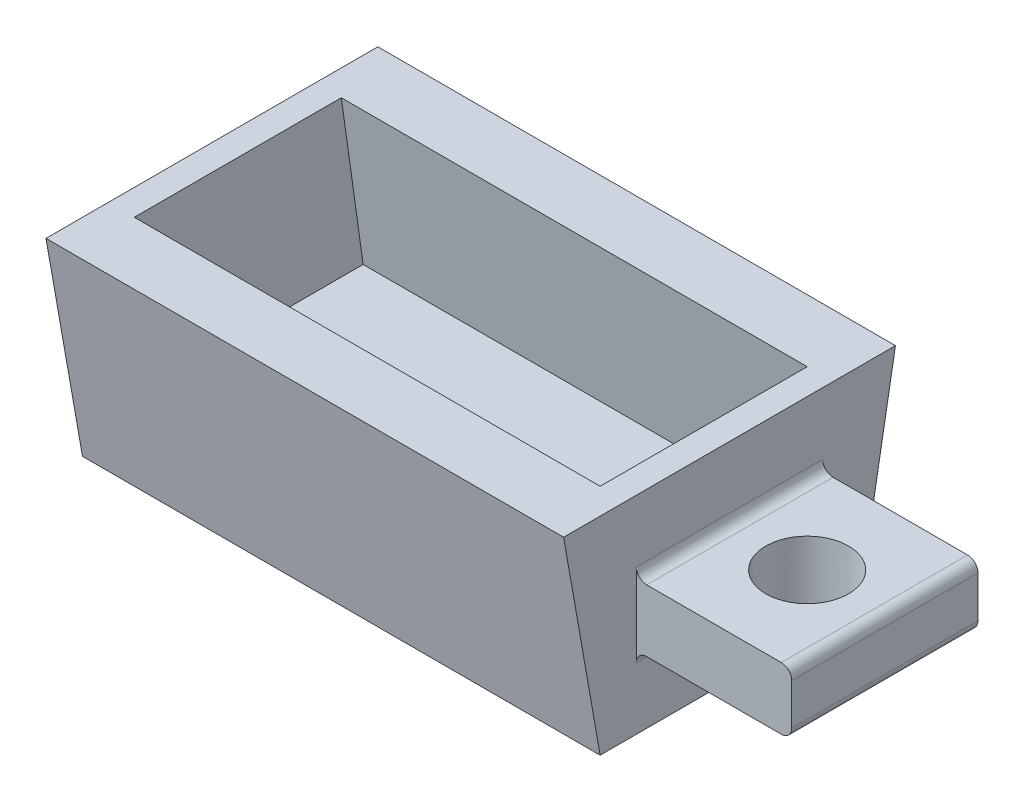
ISO-10303-21;
HEADER;
FILE_DESCRIPTION(('STEP AP214'),'2;1');
FILE_NAME('part.step','',(''),(''),'','','');
FILE_SCHEMA(('AUTOMOTIVE_DESIGN { 1 0 10303 214 1 1 1 1 }'));
ENDSEC;
DATA;
#1=APPLICATION_CONTEXT('core data for automotive mechanical design processes');
#2=APPLICATION_PROTOCOL_DEFINITION('international standard','automotive_design',2000,#1);
#3=PRODUCT_CONTEXT('',#1,'mechanical');
#4=PRODUCT('Part','Part','',(#3));
#5=PRODUCT_RELATED_PRODUCT_CATEGORY('part','',(#4));
#6=PRODUCT_DEFINITION_FORMATION('','',#4);
#7=PRODUCT_DEFINITION_CONTEXT('part definition',#1,'design');
#8=PRODUCT_DEFINITION('design','',#6,#7);
#9=PRODUCT_DEFINITION_SHAPE('','',#8);
#10=(LENGTH_UNIT() NAMED_UNIT(*) SI_UNIT(.MILLI.,.METRE.));
#11=(NAMED_UNIT(*) PLANE_ANGLE_UNIT() SI_UNIT($,.RADIAN.));
#12=(NAMED_UNIT(*) SI_UNIT($,.STERADIAN.) SOLID_ANGLE_UNIT());
#13=UNCERTAINTY_MEASURE_WITH_UNIT(LENGTH_MEASURE(1.E-05),#10,'distance_accuracy_value','');
#14=(GEOMETRIC_REPRESENTATION_CONTEXT(3) GLOBAL_UNCERTAINTY_ASSIGNED_CONTEXT((#13)) GLOBAL_UNIT_ASSIGNED_CONTEXT((#10,
#11,#12)) REPRESENTATION_CONTEXT('',''));
#15=CARTESIAN_POINT('',(0.,0.,0.));
#16=DIRECTION('',(0.,0.,1.));
#17=DIRECTION('',(1.,0.,0.));
#18=AXIS2_PLACEMENT_3D('',#15,#16,#17);
#19=CARTESIAN_POINT('',(50.,40.,-25.));
#20=DIRECTION('',(-1.,0.,0.));
#21=DIRECTION('',(0.,0.,1.));
#22=AXIS2_PLACEMENT_3D('',#19,#20,#21);
#23=PLANE('',#22);
#24=DIRECTION('',(0.,0.,-1.));
#25=VECTOR('',#24,1.);
#26=CARTESIAN_POINT('',(50.,0.,-25.));
#27=LINE('',#26,#25);
#28=CARTESIAN_POINT('',(50.,0.,25.));
#29=VERTEX_POINT('',#28);
#30=CARTESIAN_POINT('',(50.,0.,-25.));
#31=VERTEX_POINT('',#30);
#32=EDGE_CURVE('E248',#29,#31,#27,.T.);
#33=ORIENTED_EDGE('',*,*,#32,.T.);
#34=DIRECTION('',(0.,0.984807753012208,-0.173648177666931));
#35=VECTOR('',#34,1.);
#36=CARTESIAN_POINT('',(50.,0.,-25.));
#37=LINE('',#36,#35);
#38=CARTESIAN_POINT('',(50.,40.,-32.0530792283386));
#39=VERTEX_POINT('',#38);
#40=EDGE_CURVE('E212',#39,#31,#37,.F.);
#41=ORIENTED_EDGE('',*,*,#40,.F.);
#42=DIRECTION('',(0.,0.,-1.));
#43=VECTOR('',#42,1.);
#44=CARTESIAN_POINT('',(50.,40.,-25.));
#45=LINE('',#44,#43);
#46=CARTESIAN_POINT('',(50.,40.,32.0530792283386));
#47=VERTEX_POINT('',#46);
#48=EDGE_CURVE('E222',#47,#39,#45,.T.);
#49=ORIENTED_EDGE('',*,*,#48,.F.);
#50=DIRECTION('',(0.,0.984807753012208,0.173648177666931));
#51=VECTOR('',#50,1.);
#52=CARTESIAN_POINT('',(50.,30.2433488325764,30.3327183861611));
#53=LINE('',#52,#51);
#54=EDGE_CURVE('E230',#47,#29,#53,.F.);
#55=ORIENTED_EDGE('',*,*,#54,.T.);
#56=EDGE_LOOP('',(#33,#41,#49,#55));
#57=FACE_BOUND('',#56,.T.);
#58=DIRECTION('',(0.,1.,0.));
#59=VECTOR('',#58,1.);
#60=CARTESIAN_POINT('',(50.,26.,-18.));
#61=LINE('',#60,#59);
#62=CARTESIAN_POINT('',(50.,12.,-18.));
#63=VERTEX_POINT('',#62);
#64=CARTESIAN_POINT('',(50.,28.,-18.));
#65=VERTEX_POINT('',#64);
#66=EDGE_CURVE('E547',#63,#65,#61,.T.);
#67=ORIENTED_EDGE('',*,*,#66,.F.);
#68=DIRECTION('',(0.,0.,-1.));
#69=VECTOR('',#68,1.);
#70=CARTESIAN_POINT('',(50.,12.,18.));
#71=LINE('',#70,#69);
#72=CARTESIAN_POINT('',(50.,12.,18.));
#73=VERTEX_POINT('',#72);
#74=EDGE_CURVE('E310',#63,#73,#71,.F.);
#75=ORIENTED_EDGE('',*,*,#74,.T.);
#76=DIRECTION('',(0.,-1.,0.));
#77=VECTOR('',#76,1.);
#78=CARTESIAN_POINT('',(50.,26.,18.));
#79=LINE('',#78,#77);
#80=CARTESIAN_POINT('',(50.,28.,18.));
#81=VERTEX_POINT('',#80);
#82=EDGE_CURVE('E181',#81,#73,#79,.T.);
#83=ORIENTED_EDGE('',*,*,#82,.F.);
#84=DIRECTION('',(0.,0.,1.));
#85=VECTOR('',#84,1.);
#86=CARTESIAN_POINT('',(50.,28.,-18.));
#87=LINE('',#86,#85);
#88=EDGE_CURVE('E306',#81,#65,#87,.F.);
#89=ORIENTED_EDGE('',*,*,#88,.T.);
#90=EDGE_LOOP('',(#67,#75,#83,#89));
#91=FACE_BOUND('',#90,.T.);
#92=ADVANCED_FACE('F40',(#57,#91),#23,.F.);
#93=CARTESIAN_POINT('',(-50.,0.,-25.));
#94=DIRECTION('',(0.,-0.173648177666931,-0.984807753012208));
#95=DIRECTION('',(0.,0.984807753012208,-0.173648177666931));
#96=AXIS2_PLACEMENT_3D('',#93,#94,#95);
#97=PLANE('',#96);
#98=DIRECTION('',(-1.,0.,0.));
#99=VECTOR('',#98,1.);
#100=CARTESIAN_POINT('',(-50.,0.,-25.));
#101=LINE('',#100,#99);
#102=CARTESIAN_POINT('',(-50.,0.,-25.));
#103=VERTEX_POINT('',#102);
#104=EDGE_CURVE('E292',#31,#103,#101,.T.);
#105=ORIENTED_EDGE('',*,*,#104,.T.);
#106=DIRECTION('',(0.,0.984807753012208,-0.173648177666931));
#107=VECTOR('',#106,1.);
#108=CARTESIAN_POINT('',(-50.,38.7938524157182,-31.8404028665134));
#109=LINE('',#108,#107);
#110=CARTESIAN_POINT('',(-50.,40.,-32.0530792283386));
#111=VERTEX_POINT('',#110);
#112=EDGE_CURVE('E217',#111,#103,#109,.F.);
#113=ORIENTED_EDGE('',*,*,#112,.F.);
#114=DIRECTION('',(1.,0.,0.));
#115=VECTOR('',#114,1.);
#116=CARTESIAN_POINT('',(-50.,40.,-32.0530792283386));
#117=LINE('',#116,#115);
#118=EDGE_CURVE('E218',#39,#111,#117,.F.);
#119=ORIENTED_EDGE('',*,*,#118,.F.);
#120=ORIENTED_EDGE('',*,*,#40,.T.);
#121=EDGE_LOOP('',(#105,#113,#119,#120));
#122=FACE_BOUND('',#121,.T.);
#123=ADVANCED_FACE('F352',(#122),#97,.T.);
#124=CARTESIAN_POINT('',(-50.,40.,-25.));
#125=DIRECTION('',(1.,0.,0.));
#126=DIRECTION('',(0.,0.,-1.));
#127=AXIS2_PLACEMENT_3D('',#124,#125,#126);
#128=PLANE('',#127);
#129=DIRECTION('',(0.,0.,1.));
#130=VECTOR('',#129,1.);
#131=CARTESIAN_POINT('',(-50.,0.,-25.));
#132=LINE('',#131,#130);
#133=CARTESIAN_POINT('',(-50.,0.,25.));
#134=VERTEX_POINT('',#133);
#135=EDGE_CURVE('E295',#103,#134,#132,.T.);
#136=ORIENTED_EDGE('',*,*,#135,.T.);
#137=DIRECTION('',(0.,0.984807753012208,0.173648177666931));
#138=VECTOR('',#137,1.);
#139=CARTESIAN_POINT('',(-50.,0.,25.));
#140=LINE('',#139,#138);
#141=CARTESIAN_POINT('',(-50.,40.,32.0530792283386));
#142=VERTEX_POINT('',#141);
#143=EDGE_CURVE('E226',#142,#134,#140,.F.);
#144=ORIENTED_EDGE('',*,*,#143,.F.);
#145=DIRECTION('',(0.,0.,1.));
#146=VECTOR('',#145,1.);
#147=CARTESIAN_POINT('',(-50.,40.,-25.));
#148=LINE('',#147,#146);
#149=EDGE_CURVE('E221',#111,#142,#148,.T.);
#150=ORIENTED_EDGE('',*,*,#149,.F.);
#151=ORIENTED_EDGE('',*,*,#112,.T.);
#152=EDGE_LOOP('',(#136,#144,#150,#151));
#153=FACE_BOUND('',#152,.T.);
#154=ADVANCED_FACE('F359',(#153),#128,.F.);
#155=CARTESIAN_POINT('',(-50.,0.,25.));
#156=DIRECTION('',(0.,-0.173648177666931,0.984807753012208));
#157=DIRECTION('',(0.,-0.984807753012208,-0.173648177666931));
#158=AXIS2_PLACEMENT_3D('',#155,#156,#157);
#159=PLANE('',#158);
#160=DIRECTION('',(1.,0.,0.));
#161=VECTOR('',#160,1.);
#162=CARTESIAN_POINT('',(-50.,0.,25.));
#163=LINE('',#162,#161);
#164=EDGE_CURVE('E286',#134,#29,#163,.T.);
#165=ORIENTED_EDGE('',*,*,#164,.T.);
#166=ORIENTED_EDGE('',*,*,#54,.F.);
#167=DIRECTION('',(-1.,0.,0.));
#168=VECTOR('',#167,1.);
#169=CARTESIAN_POINT('',(-50.,40.,32.0530792283386));
#170=LINE('',#169,#168);
#171=EDGE_CURVE('E231',#142,#47,#170,.F.);
#172=ORIENTED_EDGE('',*,*,#171,.F.);
#173=ORIENTED_EDGE('',*,*,#143,.T.);
#174=EDGE_LOOP('',(#165,#166,#172,#173));
#175=FACE_BOUND('',#174,.T.);
#176=ADVANCED_FACE('F380',(#175),#159,.T.);
#177=CARTESIAN_POINT('',(0.,40.,0.));
#178=DIRECTION('',(0.,1.,0.));
#179=DIRECTION('',(0.,0.,1.));
#180=AXIS2_PLACEMENT_3D('',#177,#178,#179);
#181=PLANE('',#180);
#182=DIRECTION('',(0.,0.,-1.));
#183=VECTOR('',#182,1.);
#184=CARTESIAN_POINT('',(45.,40.,-20.));
#185=LINE('',#184,#183);
#186=CARTESIAN_POINT('',(45.,40.,20.));
#187=VERTEX_POINT('',#186);
#188=CARTESIAN_POINT('',(45.,40.,-20.));
#189=VERTEX_POINT('',#188);
#190=EDGE_CURVE('E272',#187,#189,#185,.T.);
#191=ORIENTED_EDGE('',*,*,#190,.F.);
#192=DIRECTION('',(1.,0.,0.));
#193=VECTOR('',#192,1.);
#194=CARTESIAN_POINT('',(-45.,40.,20.));
#195=LINE('',#194,#193);
#196=CARTESIAN_POINT('',(-45.,40.,20.));
#197=VERTEX_POINT('',#196);
#198=EDGE_CURVE('E276',#197,#187,#195,.T.);
#199=ORIENTED_EDGE('',*,*,#198,.F.);
#200=DIRECTION('',(0.,0.,1.));
#201=VECTOR('',#200,1.);
#202=CARTESIAN_POINT('',(-45.,40.,-20.));
#203=LINE('',#202,#201);
#204=CARTESIAN_POINT('',(-45.,40.,-20.));
#205=VERTEX_POINT('',#204);
#206=EDGE_CURVE('E263',#205,#197,#203,.T.);
#207=ORIENTED_EDGE('',*,*,#206,.F.);
#208=DIRECTION('',(-1.,0.,0.));
#209=VECTOR('',#208,1.);
#210=CARTESIAN_POINT('',(-45.,40.,-20.));
#211=LINE('',#210,#209);
#212=EDGE_CURVE('E268',#189,#205,#211,.T.);
#213=ORIENTED_EDGE('',*,*,#212,.F.);
#214=EDGE_LOOP('',(#191,#199,#207,#213));
#215=FACE_BOUND('',#214,.T.);
#216=ORIENTED_EDGE('',*,*,#48,.T.);
#217=ORIENTED_EDGE('',*,*,#118,.T.);
#218=ORIENTED_EDGE('',*,*,#149,.T.);
#219=ORIENTED_EDGE('',*,*,#171,.T.);
#220=EDGE_LOOP('',(#216,#217,#218,#219));
#221=FACE_BOUND('',#220,.T.);
#222=ADVANCED_FACE('F274',(#215,#221),#181,.T.);
#223=CARTESIAN_POINT('',(0.,0.,0.));
#224=DIRECTION('',(0.,1.,0.));
#225=DIRECTION('',(0.,0.,1.));
#226=AXIS2_PLACEMENT_3D('',#223,#224,#225);
#227=PLANE('',#226);
#228=ORIENTED_EDGE('',*,*,#32,.F.);
#229=ORIENTED_EDGE('',*,*,#164,.F.);
#230=ORIENTED_EDGE('',*,*,#135,.F.);
#231=ORIENTED_EDGE('',*,*,#104,.F.);
#232=EDGE_LOOP('',(#228,#229,#230,#231));
#233=FACE_BOUND('',#232,.T.);
#234=ADVANCED_FACE('F339',(#233),#227,.F.);
#235=CARTESIAN_POINT('',(45.,10.,-20.));
#236=DIRECTION('',(1.,0.,0.));
#237=DIRECTION('',(0.,0.,-1.));
#238=AXIS2_PLACEMENT_3D('',#235,#236,#237);
#239=PLANE('',#238);
#240=ORIENTED_EDGE('',*,*,#190,.T.);
#241=DIRECTION('',(0.,-0.99026806874157,-0.139173100960066));
#242=VECTOR('',#241,1.);
#243=CARTESIAN_POINT('',(45.,10.5810745609252,-24.134560337255));
#244=LINE('',#243,#242);
#245=CARTESIAN_POINT('',(45.,10.,-24.2162250410718));
#246=VERTEX_POINT('',#245);
#247=EDGE_CURVE('E94',#246,#189,#244,.F.);
#248=ORIENTED_EDGE('',*,*,#247,.F.);
#249=DIRECTION('',(0.,0.,-1.));
#250=VECTOR('',#249,1.);
#251=CARTESIAN_POINT('',(45.,10.,-20.));
#252=LINE('',#251,#250);
#253=CARTESIAN_POINT('',(45.,10.,24.2162250410717));
#254=VERTEX_POINT('',#253);
#255=EDGE_CURVE('E254',#254,#246,#252,.T.);
#256=ORIENTED_EDGE('',*,*,#255,.F.);
#257=DIRECTION('',(0.,-0.99026806874157,0.139173100960066));
#258=VECTOR('',#257,1.);
#259=CARTESIAN_POINT('',(45.,40.,20.));
#260=LINE('',#259,#258);
#261=EDGE_CURVE('E100',#254,#187,#260,.F.);
#262=ORIENTED_EDGE('',*,*,#261,.T.);
#263=EDGE_LOOP('',(#240,#248,#256,#262));
#264=FACE_BOUND('',#263,.T.);
#265=ADVANCED_FACE('F336',(#264),#239,.F.);
#266=CARTESIAN_POINT('',(-45.,40.,20.));
#267=DIRECTION('',(0.,-0.139173100960066,-0.99026806874157));
#268=DIRECTION('',(0.,0.99026806874157,-0.139173100960066));
#269=AXIS2_PLACEMENT_3D('',#266,#267,#268);
#270=PLANE('',#269);
#271=ORIENTED_EDGE('',*,*,#198,.T.);
#272=ORIENTED_EDGE('',*,*,#261,.F.);
#273=DIRECTION('',(-1.,0.,0.));
#274=VECTOR('',#273,1.);
#275=CARTESIAN_POINT('',(0.,10.,24.2162250410717));
#276=LINE('',#275,#274);
#277=CARTESIAN_POINT('',(-45.,10.,24.2162250410717));
#278=VERTEX_POINT('',#277);
#279=EDGE_CURVE('E241',#278,#254,#276,.F.);
#280=ORIENTED_EDGE('',*,*,#279,.F.);
#281=DIRECTION('',(0.,-0.99026806874157,0.139173100960066));
#282=VECTOR('',#281,1.);
#283=CARTESIAN_POINT('',(-45.,16.0938216772652,23.3597942560214));
#284=LINE('',#283,#282);
#285=EDGE_CURVE('E237',#278,#197,#284,.F.);
#286=ORIENTED_EDGE('',*,*,#285,.T.);
#287=EDGE_LOOP('',(#271,#272,#280,#286));
#288=FACE_BOUND('',#287,.T.);
#289=ADVANCED_FACE('F338',(#288),#270,.T.);
#290=CARTESIAN_POINT('',(-45.,10.,-20.));
#291=DIRECTION('',(-1.,0.,0.));
#292=DIRECTION('',(0.,0.,1.));
#293=AXIS2_PLACEMENT_3D('',#290,#291,#292);
#294=PLANE('',#293);
#295=ORIENTED_EDGE('',*,*,#206,.T.);
#296=ORIENTED_EDGE('',*,*,#285,.F.);
#297=DIRECTION('',(0.,0.,1.));
#298=VECTOR('',#297,1.);
#299=CARTESIAN_POINT('',(-45.,10.,-20.));
#300=LINE('',#299,#298);
#301=CARTESIAN_POINT('',(-45.,10.,-24.2162250410718));
#302=VERTEX_POINT('',#301);
#303=EDGE_CURVE('E245',#302,#278,#300,.T.);
#304=ORIENTED_EDGE('',*,*,#303,.F.);
#305=DIRECTION('',(0.,-0.99026806874157,-0.139173100960066));
#306=VECTOR('',#305,1.);
#307=CARTESIAN_POINT('',(-45.,40.,-20.));
#308=LINE('',#307,#306);
#309=EDGE_CURVE('E240',#302,#205,#308,.F.);
#310=ORIENTED_EDGE('',*,*,#309,.T.);
#311=EDGE_LOOP('',(#295,#296,#304,#310));
#312=FACE_BOUND('',#311,.T.);
#313=ADVANCED_FACE('F261',(#312),#294,.F.);
#314=CARTESIAN_POINT('',(-45.,40.,-20.));
#315=DIRECTION('',(0.,-0.139173100960066,0.99026806874157));
#316=DIRECTION('',(0.,-0.99026806874157,-0.139173100960066));
#317=AXIS2_PLACEMENT_3D('',#314,#315,#316);
#318=PLANE('',#317);
#319=ORIENTED_EDGE('',*,*,#212,.T.);
#320=ORIENTED_EDGE('',*,*,#309,.F.);
#321=DIRECTION('',(1.,0.,0.));
#322=VECTOR('',#321,1.);
#323=CARTESIAN_POINT('',(0.,10.,-24.2162250410717));
#324=LINE('',#323,#322);
#325=EDGE_CURVE('E251',#246,#302,#324,.F.);
#326=ORIENTED_EDGE('',*,*,#325,.F.);
#327=ORIENTED_EDGE('',*,*,#247,.T.);
#328=EDGE_LOOP('',(#319,#320,#326,#327));
#329=FACE_BOUND('',#328,.T.);
#330=ADVANCED_FACE('F42',(#329),#318,.T.);
#331=CARTESIAN_POINT('',(0.,10.,0.));
#332=DIRECTION('',(0.,1.,0.));
#333=DIRECTION('',(0.,0.,1.));
#334=AXIS2_PLACEMENT_3D('',#331,#332,#333);
#335=PLANE('',#334);
#336=ORIENTED_EDGE('',*,*,#255,.T.);
#337=ORIENTED_EDGE('',*,*,#325,.T.);
#338=ORIENTED_EDGE('',*,*,#303,.T.);
#339=ORIENTED_EDGE('',*,*,#279,.T.);
#340=EDGE_LOOP('',(#336,#337,#338,#339));
#341=FACE_BOUND('',#340,.T.);
#342=ADVANCED_FACE('F413',(#341),#335,.T.);
#343=CARTESIAN_POINT('',(80.,26.,-18.));
#344=DIRECTION('',(0.,0.,1.));
#345=DIRECTION('',(1.,0.,0.));
#346=AXIS2_PLACEMENT_3D('',#343,#344,#345);
#347=PLANE('',#346);
#348=DIRECTION('',(0.,1.,0.));
#349=VECTOR('',#348,1.);
#350=CARTESIAN_POINT('',(80.,26.,-18.));
#351=LINE('',#350,#349);
#352=CARTESIAN_POINT('',(80.,16.,-18.));
#353=VERTEX_POINT('',#352);
#354=CARTESIAN_POINT('',(80.,24.,-18.));
#355=VERTEX_POINT('',#354);
#356=EDGE_CURVE('E163',#353,#355,#351,.T.);
#357=ORIENTED_EDGE('',*,*,#356,.F.);
#358=CARTESIAN_POINT('',(78.,16.,-18.));
#359=DIRECTION('',(0.,0.,1.));
#360=DIRECTION('',(1.,0.,0.));
#361=AXIS2_PLACEMENT_3D('',#358,#359,#360);
#362=CIRCLE('',#361,2.);
#363=CARTESIAN_POINT('',(78.,14.,-18.));
#364=VERTEX_POINT('',#363);
#365=EDGE_CURVE('E170',#353,#364,#362,.F.);
#366=ORIENTED_EDGE('',*,*,#365,.T.);
#367=DIRECTION('',(-1.,0.,0.));
#368=VECTOR('',#367,1.);
#369=CARTESIAN_POINT('',(80.,14.,-18.));
#370=LINE('',#369,#368);
#371=CARTESIAN_POINT('',(52.,14.,-18.));
#372=VERTEX_POINT('',#371);
#373=EDGE_CURVE('E327',#364,#372,#370,.T.);
#374=ORIENTED_EDGE('',*,*,#373,.T.);
#375=CARTESIAN_POINT('',(52.,12.,-18.));
#376=DIRECTION('',(0.,0.,1.));
#377=DIRECTION('',(1.,0.,0.));
#378=AXIS2_PLACEMENT_3D('',#375,#376,#377);
#379=CIRCLE('',#378,2.);
#380=EDGE_CURVE('E202',#372,#63,#379,.T.);
#381=ORIENTED_EDGE('',*,*,#380,.T.);
#382=ORIENTED_EDGE('',*,*,#66,.T.);
#383=CARTESIAN_POINT('',(52.,28.,-18.));
#384=DIRECTION('',(0.,0.,1.));
#385=DIRECTION('',(1.,0.,0.));
#386=AXIS2_PLACEMENT_3D('',#383,#384,#385);
#387=CIRCLE('',#386,2.);
#388=CARTESIAN_POINT('',(52.,26.,-18.));
#389=VERTEX_POINT('',#388);
#390=EDGE_CURVE('E11',#65,#389,#387,.T.);
#391=ORIENTED_EDGE('',*,*,#390,.T.);
#392=DIRECTION('',(-1.,0.,0.));
#393=VECTOR('',#392,1.);
#394=CARTESIAN_POINT('',(80.,26.,-18.));
#395=LINE('',#394,#393);
#396=CARTESIAN_POINT('',(78.,26.,-18.));
#397=VERTEX_POINT('',#396);
#398=EDGE_CURVE('E165',#397,#389,#395,.T.);
#399=ORIENTED_EDGE('',*,*,#398,.F.);
#400=CARTESIAN_POINT('',(78.,24.,-18.));
#401=DIRECTION('',(0.,0.,1.));
#402=DIRECTION('',(1.,0.,0.));
#403=AXIS2_PLACEMENT_3D('',#400,#401,#402);
#404=CIRCLE('',#403,2.);
#405=EDGE_CURVE('E160',#397,#355,#404,.F.);
#406=ORIENTED_EDGE('',*,*,#405,.T.);
#407=EDGE_LOOP('',(#357,#366,#374,#381,#382,#391,#399,#406));
#408=FACE_BOUND('',#407,.T.);
#409=ADVANCED_FACE('F162',(#408),#347,.F.);
#410=CARTESIAN_POINT('',(80.,26.,18.));
#411=DIRECTION('',(0.,-1.,0.));
#412=DIRECTION('',(0.,0.,-1.));
#413=AXIS2_PLACEMENT_3D('',#410,#411,#412);
#414=PLANE('',#413);
#415=CARTESIAN_POINT('',(65.,26.,0.));
#416=DIRECTION('',(0.,1.,0.));
#417=DIRECTION('',(0.,0.,1.));
#418=AXIS2_PLACEMENT_3D('',#415,#416,#417);
#419=CIRCLE('',#418,8.00000000000001);
#420=CARTESIAN_POINT('',(65.,26.,8.));
#421=VERTEX_POINT('',#420);
#422=EDGE_CURVE('E543',#421,#421,#419,.T.);
#423=ORIENTED_EDGE('',*,*,#422,.F.);
#424=EDGE_LOOP('',(#423));
#425=FACE_BOUND('',#424,.T.);
#426=ORIENTED_EDGE('',*,*,#398,.T.);
#427=DIRECTION('',(0.,0.,1.));
#428=VECTOR('',#427,1.);
#429=CARTESIAN_POINT('',(52.,26.,18.));
#430=LINE('',#429,#428);
#431=CARTESIAN_POINT('',(52.,26.,18.));
#432=VERTEX_POINT('',#431);
#433=EDGE_CURVE('E186',#389,#432,#430,.T.);
#434=ORIENTED_EDGE('',*,*,#433,.T.);
#435=DIRECTION('',(-1.,0.,0.));
#436=VECTOR('',#435,1.);
#437=CARTESIAN_POINT('',(80.,26.,18.));
#438=LINE('',#437,#436);
#439=CARTESIAN_POINT('',(78.,26.,18.));
#440=VERTEX_POINT('',#439);
#441=EDGE_CURVE('E319',#440,#432,#438,.T.);
#442=ORIENTED_EDGE('',*,*,#441,.F.);
#443=DIRECTION('',(0.,0.,1.));
#444=VECTOR('',#443,1.);
#445=CARTESIAN_POINT('',(78.,26.,-18.));
#446=LINE('',#445,#444);
#447=EDGE_CURVE('E192',#440,#397,#446,.F.);
#448=ORIENTED_EDGE('',*,*,#447,.T.);
#449=EDGE_LOOP('',(#426,#434,#442,#448));
#450=FACE_BOUND('',#449,.T.);
#451=ADVANCED_FACE('F316',(#425,#450),#414,.F.);
#452=CARTESIAN_POINT('',(80.,26.,18.));
#453=DIRECTION('',(0.,0.,-1.));
#454=DIRECTION('',(0.,1.,0.));
#455=AXIS2_PLACEMENT_3D('',#452,#453,#454);
#456=PLANE('',#455);
#457=DIRECTION('',(-1.,0.,0.));
#458=VECTOR('',#457,1.);
#459=CARTESIAN_POINT('',(80.,14.,18.));
#460=LINE('',#459,#458);
#461=CARTESIAN_POINT('',(78.,14.,18.));
#462=VERTEX_POINT('',#461);
#463=CARTESIAN_POINT('',(52.,14.,18.));
#464=VERTEX_POINT('',#463);
#465=EDGE_CURVE('E321',#462,#464,#460,.T.);
#466=ORIENTED_EDGE('',*,*,#465,.F.);
#467=CARTESIAN_POINT('',(78.,16.,18.));
#468=DIRECTION('',(0.,0.,-1.));
#469=DIRECTION('',(0.,1.,0.));
#470=AXIS2_PLACEMENT_3D('',#467,#468,#469);
#471=CIRCLE('',#470,2.);
#472=CARTESIAN_POINT('',(80.,16.,18.));
#473=VERTEX_POINT('',#472);
#474=EDGE_CURVE('E60',#462,#473,#471,.F.);
#475=ORIENTED_EDGE('',*,*,#474,.T.);
#476=DIRECTION('',(0.,-1.,0.));
#477=VECTOR('',#476,1.);
#478=CARTESIAN_POINT('',(80.,26.,18.));
#479=LINE('',#478,#477);
#480=CARTESIAN_POINT('',(80.,24.,18.));
#481=VERTEX_POINT('',#480);
#482=EDGE_CURVE('E180',#481,#473,#479,.T.);
#483=ORIENTED_EDGE('',*,*,#482,.F.);
#484=CARTESIAN_POINT('',(78.,24.,18.));
#485=DIRECTION('',(0.,0.,-1.));
#486=DIRECTION('',(0.,1.,0.));
#487=AXIS2_PLACEMENT_3D('',#484,#485,#486);
#488=CIRCLE('',#487,2.);
#489=EDGE_CURVE('E184',#481,#440,#488,.F.);
#490=ORIENTED_EDGE('',*,*,#489,.T.);
#491=ORIENTED_EDGE('',*,*,#441,.T.);
#492=CARTESIAN_POINT('',(52.,28.,18.));
#493=DIRECTION('',(0.,0.,-1.));
#494=DIRECTION('',(0.,1.,0.));
#495=AXIS2_PLACEMENT_3D('',#492,#493,#494);
#496=CIRCLE('',#495,2.);
#497=EDGE_CURVE('E51',#432,#81,#496,.T.);
#498=ORIENTED_EDGE('',*,*,#497,.T.);
#499=ORIENTED_EDGE('',*,*,#82,.T.);
#500=CARTESIAN_POINT('',(52.,12.,18.));
#501=DIRECTION('',(0.,0.,-1.));
#502=DIRECTION('',(0.,1.,0.));
#503=AXIS2_PLACEMENT_3D('',#500,#501,#502);
#504=CIRCLE('',#503,2.);
#505=EDGE_CURVE('E206',#73,#464,#504,.T.);
#506=ORIENTED_EDGE('',*,*,#505,.T.);
#507=EDGE_LOOP('',(#466,#475,#483,#490,#491,#498,#499,#506));
#508=FACE_BOUND('',#507,.T.);
#509=ADVANCED_FACE('F430',(#508),#456,.F.);
#510=CARTESIAN_POINT('',(80.,14.,18.));
#511=DIRECTION('',(0.,1.,0.));
#512=DIRECTION('',(0.,0.,1.));
#513=AXIS2_PLACEMENT_3D('',#510,#511,#512);
#514=PLANE('',#513);
#515=CARTESIAN_POINT('',(65.,14.,0.));
#516=DIRECTION('',(0.,1.,0.));
#517=DIRECTION('',(0.,0.,1.));
#518=AXIS2_PLACEMENT_3D('',#515,#516,#517);
#519=CIRCLE('',#518,7.37110664860352);
#520=CARTESIAN_POINT('',(65.,14.,7.37110664860351));
#521=VERTEX_POINT('',#520);
#522=EDGE_CURVE('E44',#521,#521,#519,.T.);
#523=ORIENTED_EDGE('',*,*,#522,.T.);
#524=EDGE_LOOP('',(#523));
#525=FACE_BOUND('',#524,.T.);
#526=ORIENTED_EDGE('',*,*,#465,.T.);
#527=DIRECTION('',(0.,0.,-1.));
#528=VECTOR('',#527,1.);
#529=CARTESIAN_POINT('',(52.,14.,-18.));
#530=LINE('',#529,#528);
#531=EDGE_CURVE('E302',#464,#372,#530,.T.);
#532=ORIENTED_EDGE('',*,*,#531,.T.);
#533=ORIENTED_EDGE('',*,*,#373,.F.);
#534=DIRECTION('',(0.,0.,-1.));
#535=VECTOR('',#534,1.);
#536=CARTESIAN_POINT('',(78.,14.,18.));
#537=LINE('',#536,#535);
#538=EDGE_CURVE('E216',#364,#462,#537,.F.);
#539=ORIENTED_EDGE('',*,*,#538,.T.);
#540=EDGE_LOOP('',(#526,#532,#533,#539));
#541=FACE_BOUND('',#540,.T.);
#542=ADVANCED_FACE('F439',(#525,#541),#514,.F.);
#543=CARTESIAN_POINT('',(80.,0.,0.));
#544=DIRECTION('',(1.,0.,0.));
#545=DIRECTION('',(0.,0.,-1.));
#546=AXIS2_PLACEMENT_3D('',#543,#544,#545);
#547=PLANE('',#546);
#548=ORIENTED_EDGE('',*,*,#482,.T.);
#549=DIRECTION('',(0.,0.,-1.));
#550=VECTOR('',#549,1.);
#551=CARTESIAN_POINT('',(80.,16.,-18.));
#552=LINE('',#551,#550);
#553=EDGE_CURVE('E171',#473,#353,#552,.T.);
#554=ORIENTED_EDGE('',*,*,#553,.T.);
#555=ORIENTED_EDGE('',*,*,#356,.T.);
#556=DIRECTION('',(0.,0.,1.));
#557=VECTOR('',#556,1.);
#558=CARTESIAN_POINT('',(80.,24.,18.));
#559=LINE('',#558,#557);
#560=EDGE_CURVE('E177',#355,#481,#559,.T.);
#561=ORIENTED_EDGE('',*,*,#560,.T.);
#562=EDGE_LOOP('',(#548,#554,#555,#561));
#563=FACE_BOUND('',#562,.T.);
#564=ADVANCED_FACE('F176',(#563),#547,.T.);
#565=CARTESIAN_POINT('',(52.,12.,18.));
#566=DIRECTION('',(0.,0.,1.));
#567=DIRECTION('',(1.,0.,0.));
#568=AXIS2_PLACEMENT_3D('',#565,#566,#567);
#569=CYLINDRICAL_SURFACE('',#568,2.);
#570=ORIENTED_EDGE('',*,*,#505,.F.);
#571=ORIENTED_EDGE('',*,*,#74,.F.);
#572=ORIENTED_EDGE('',*,*,#380,.F.);
#573=ORIENTED_EDGE('',*,*,#531,.F.);
#574=EDGE_LOOP('',(#570,#571,#572,#573));
#575=FACE_BOUND('',#574,.T.);
#576=ADVANCED_FACE('F365',(#575),#569,.F.);
#577=CARTESIAN_POINT('',(52.,28.,18.));
#578=DIRECTION('',(0.,0.,-1.));
#579=DIRECTION('',(-1.,0.,0.));
#580=AXIS2_PLACEMENT_3D('',#577,#578,#579);
#581=CYLINDRICAL_SURFACE('',#580,2.);
#582=ORIENTED_EDGE('',*,*,#390,.F.);
#583=ORIENTED_EDGE('',*,*,#88,.F.);
#584=ORIENTED_EDGE('',*,*,#497,.F.);
#585=ORIENTED_EDGE('',*,*,#433,.F.);
#586=EDGE_LOOP('',(#582,#583,#584,#585));
#587=FACE_BOUND('',#586,.T.);
#588=ADVANCED_FACE('F368',(#587),#581,.F.);
#589=CARTESIAN_POINT('',(78.,16.,0.));
#590=DIRECTION('',(0.,0.,1.));
#591=DIRECTION('',(1.,0.,0.));
#592=AXIS2_PLACEMENT_3D('',#589,#590,#591);
#593=CYLINDRICAL_SURFACE('',#592,2.);
#594=ORIENTED_EDGE('',*,*,#474,.F.);
#595=ORIENTED_EDGE('',*,*,#538,.F.);
#596=ORIENTED_EDGE('',*,*,#365,.F.);
#597=ORIENTED_EDGE('',*,*,#553,.F.);
#598=EDGE_LOOP('',(#594,#595,#596,#597));
#599=FACE_BOUND('',#598,.T.);
#600=ADVANCED_FACE('F372',(#599),#593,.T.);
#601=CARTESIAN_POINT('',(78.,24.,0.));
#602=DIRECTION('',(0.,0.,-1.));
#603=DIRECTION('',(-1.,0.,0.));
#604=AXIS2_PLACEMENT_3D('',#601,#602,#603);
#605=CYLINDRICAL_SURFACE('',#604,2.);
#606=ORIENTED_EDGE('',*,*,#405,.F.);
#607=ORIENTED_EDGE('',*,*,#447,.F.);
#608=ORIENTED_EDGE('',*,*,#489,.F.);
#609=ORIENTED_EDGE('',*,*,#560,.F.);
#610=EDGE_LOOP('',(#606,#607,#608,#609));
#611=FACE_BOUND('',#610,.T.);
#612=ADVANCED_FACE('F183',(#611),#605,.T.);
#613=CARTESIAN_POINT('',(65.,26.,0.));
#614=DIRECTION('',(0.,1.,0.));
#615=DIRECTION('',(0.,0.,1.));
#616=AXIS2_PLACEMENT_3D('',#613,#614,#615);
#617=CONICAL_SURFACE('',#616,8.00000000000001,0.0523598775598299);
#618=ORIENTED_EDGE('',*,*,#422,.T.);
#619=EDGE_LOOP('',(#618));
#620=FACE_BOUND('',#619,.T.);
#621=ORIENTED_EDGE('',*,*,#522,.F.);
#622=EDGE_LOOP('',(#621));
#623=FACE_BOUND('',#622,.T.);
#624=ADVANCED_FACE('F378',(#620,#623),#617,.F.);
#625=CLOSED_SHELL('',(#92,#123,#154,#176,#222,#234,#265,#289,#313,#330,#342,#409,#451,#509,#542,
#564,#576,#588,#600,#612,#624));
#626=MANIFOLD_SOLID_BREP('B2',#625);
#627=ADVANCED_BREP_SHAPE_REPRESENTATION('',(#18,#626),#14);
#628=SHAPE_DEFINITION_REPRESENTATION(#9,#627);
ENDSEC;
END-ISO-10303-21;
